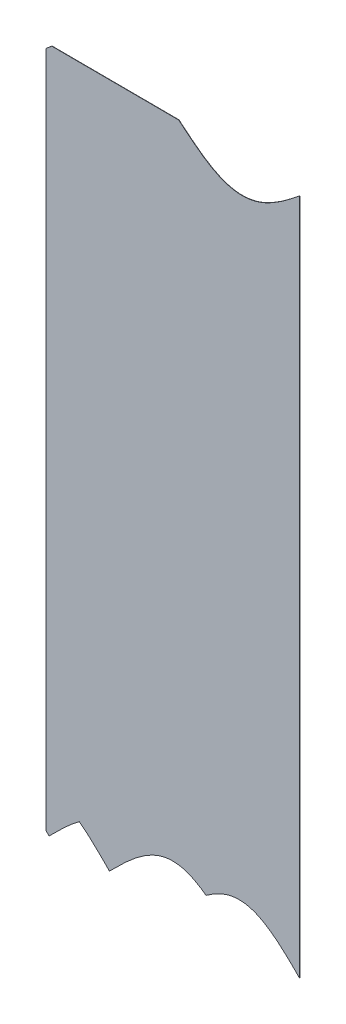
ISO-10303-21;
HEADER;
FILE_DESCRIPTION(('STEP AP214'),'2;1');
FILE_NAME('part.step','',(''),(''),'','','');
FILE_SCHEMA(('AUTOMOTIVE_DESIGN { 1 0 10303 214 1 1 1 1 }'));
ENDSEC;
DATA;
#1=APPLICATION_CONTEXT('core data for automotive mechanical design processes');
#2=APPLICATION_PROTOCOL_DEFINITION('international standard','automotive_design',2000,#1);
#3=PRODUCT_CONTEXT('',#1,'mechanical');
#4=PRODUCT('Part','Part','',(#3));
#5=PRODUCT_RELATED_PRODUCT_CATEGORY('part','',(#4));
#6=PRODUCT_DEFINITION_FORMATION('','',#4);
#7=PRODUCT_DEFINITION_CONTEXT('part definition',#1,'design');
#8=PRODUCT_DEFINITION('design','',#6,#7);
#9=PRODUCT_DEFINITION_SHAPE('','',#8);
#10=(LENGTH_UNIT() NAMED_UNIT(*) SI_UNIT(.MILLI.,.METRE.));
#11=(NAMED_UNIT(*) PLANE_ANGLE_UNIT() SI_UNIT($,.RADIAN.));
#12=(NAMED_UNIT(*) SI_UNIT($,.STERADIAN.) SOLID_ANGLE_UNIT());
#13=UNCERTAINTY_MEASURE_WITH_UNIT(LENGTH_MEASURE(1.E-05),#10,'distance_accuracy_value','');
#14=(GEOMETRIC_REPRESENTATION_CONTEXT(3) GLOBAL_UNCERTAINTY_ASSIGNED_CONTEXT((#13)) GLOBAL_UNIT_ASSIGNED_CONTEXT((#10,
#11,#12)) REPRESENTATION_CONTEXT('',''));
#15=CARTESIAN_POINT('',(0.,0.,0.));
#16=DIRECTION('',(0.,0.,1.));
#17=DIRECTION('',(1.,0.,0.));
#18=AXIS2_PLACEMENT_3D('',#15,#16,#17);
#19=CARTESIAN_POINT('',(322.330788957895,481.431997369776,168.147839988997));
#20=DIRECTION('',(0.757872648002997,0.652395697796506,0.00298377370707072));
#21=DIRECTION('',(0.652398601924532,-0.75787602165982,0.));
#22=AXIS2_PLACEMENT_3D('',#19,#20,#21);
#23=PLANE('',#22);
#24=CARTESIAN_POINT('',(322.330395257108,481.431997369776,168.247839213992));
#25=CARTESIAN_POINT('',(322.334377498887,481.427371222006,168.247854892231));
#26=B_SPLINE_CURVE_WITH_KNOTS('',1,(#24,#25),.UNSPECIFIED.,.F.,.F.,(2,2),(0.,1.),.UNSPECIFIED.);
#27=CARTESIAN_POINT('',(322.330395583371,481.431996990757,168.247839215277));
#28=VERTEX_POINT('',#27);
#29=CARTESIAN_POINT('',(322.334377620597,481.427371847329,168.24785489271));
#30=VERTEX_POINT('',#29);
#31=EDGE_CURVE('E184',#28,#30,#26,.T.);
#32=ORIENTED_EDGE('',*,*,#31,.T.);
#33=DIRECTION('',(-0.00393700787401531,0.,0.999992249954468));
#34=VECTOR('',#33,1.);
#35=CARTESIAN_POINT('',(322.334771321385,481.427371847329,168.147855667715));
#36=LINE('',#35,#34);
#37=CARTESIAN_POINT('',(322.334771321385,481.427371847329,168.147855667715));
#38=VERTEX_POINT('',#37);
#39=EDGE_CURVE('E183',#38,#30,#36,.T.);
#40=ORIENTED_EDGE('',*,*,#39,.F.);
#41=CARTESIAN_POINT('',(322.330788957895,481.431997369776,168.147839988997));
#42=CARTESIAN_POINT('',(322.334771199674,481.427371222006,168.147855667235));
#43=B_SPLINE_CURVE_WITH_KNOTS('',1,(#41,#42),.UNSPECIFIED.,.F.,.F.,(2,2),(0.,1.),.UNSPECIFIED.);
#44=CARTESIAN_POINT('',(322.330789284159,481.431996990757,168.147839990281));
#45=VERTEX_POINT('',#44);
#46=EDGE_CURVE('E272',#45,#38,#43,.T.);
#47=ORIENTED_EDGE('',*,*,#46,.F.);
#48=DIRECTION('',(-0.00393700787401531,0.,0.999992249954468));
#49=VECTOR('',#48,1.);
#50=CARTESIAN_POINT('',(322.330789284159,481.431996990757,168.147839990281));
#51=LINE('',#50,#49);
#52=EDGE_CURVE('E13',#45,#28,#51,.T.);
#53=ORIENTED_EDGE('',*,*,#52,.T.);
#54=EDGE_LOOP('',(#32,#40,#47,#53));
#55=FACE_BOUND('',#54,.T.);
#56=ADVANCED_FACE('F43',(#55),#23,.T.);
#57=CARTESIAN_POINT('',(320.56832134094,479.98219318182,168.140901086334));
#58=CARTESIAN_POINT('',(320.960198959357,480.302507821558,168.142443923561));
#59=CARTESIAN_POINT('',(321.890590486305,481.068483708455,168.146106910717));
#60=CARTESIAN_POINT('',(322.330788957895,481.431997369776,168.147839988997));
#61=B_SPLINE_CURVE_WITH_KNOTS('',2,(#57,#58,#59,#60),.UNSPECIFIED.,.F.,.F.,(3,1,3),(0.,0.5,1.),.UNSPECIFIED.);
#62=DIRECTION('',(-0.00393700787401531,0.,0.999992249954468));
#63=VECTOR('',#62,1.);
#64=SURFACE_OF_LINEAR_EXTRUSION('',#61,#63);
#65=CARTESIAN_POINT('',(320.567927640152,479.98219318182,168.24090031133));
#66=CARTESIAN_POINT('',(320.95980525857,480.302507821558,168.242443148556));
#67=CARTESIAN_POINT('',(321.890196785517,481.068483708455,168.246106135712));
#68=CARTESIAN_POINT('',(322.330395257108,481.431997369776,168.247839213992));
#69=B_SPLINE_CURVE_WITH_KNOTS('',2,(#65,#66,#67,#68),.UNSPECIFIED.,.F.,.F.,(3,1,3),(0.,0.5,1.),.UNSPECIFIED.);
#70=CARTESIAN_POINT('',(320.567927640152,479.98219318182,168.24090031133));
#71=VERTEX_POINT('',#70);
#72=EDGE_CURVE('E192',#71,#28,#69,.T.);
#73=ORIENTED_EDGE('',*,*,#72,.T.);
#74=ORIENTED_EDGE('',*,*,#52,.F.);
#75=CARTESIAN_POINT('',(320.56832134094,479.98219318182,168.140901086334));
#76=VERTEX_POINT('',#75);
#77=EDGE_CURVE('E115',#76,#45,#61,.T.);
#78=ORIENTED_EDGE('',*,*,#77,.F.);
#79=DIRECTION('',(-0.00393700787401531,0.,0.999992249954468));
#80=VECTOR('',#79,1.);
#81=CARTESIAN_POINT('',(320.56832134094,479.98219318182,168.140901086334));
#82=LINE('',#81,#80);
#83=EDGE_CURVE('E51',#76,#71,#82,.T.);
#84=ORIENTED_EDGE('',*,*,#83,.T.);
#85=EDGE_LOOP('',(#73,#74,#78,#84));
#86=FACE_BOUND('',#85,.T.);
#87=ADVANCED_FACE('F306',(#86),#64,.F.);
#88=CARTESIAN_POINT('',(320.56832134094,268.328764497974,168.140901086334));
#89=DIRECTION('',(-0.999992249954468,0.,-0.00393700787401531));
#90=DIRECTION('',(0.00393700787401531,0.,-0.999992249954468));
#91=AXIS2_PLACEMENT_3D('',#88,#89,#90);
#92=PLANE('',#91);
#93=DIRECTION('',(0.,1.,0.));
#94=VECTOR('',#93,1.);
#95=CARTESIAN_POINT('',(320.567927640152,268.328764497974,168.24090031133));
#96=LINE('',#95,#94);
#97=CARTESIAN_POINT('',(320.567927640152,268.328764497975,168.24090031133));
#98=VERTEX_POINT('',#97);
#99=EDGE_CURVE('E199',#98,#71,#96,.T.);
#100=ORIENTED_EDGE('',*,*,#99,.T.);
#101=ORIENTED_EDGE('',*,*,#83,.F.);
#102=DIRECTION('',(0.,1.,0.));
#103=VECTOR('',#102,1.);
#104=CARTESIAN_POINT('',(320.56832134094,268.328764497974,168.140901086334));
#105=LINE('',#104,#103);
#106=CARTESIAN_POINT('',(320.56832134094,268.328764497975,168.140901086334));
#107=VERTEX_POINT('',#106);
#108=EDGE_CURVE('E315',#107,#76,#105,.T.);
#109=ORIENTED_EDGE('',*,*,#108,.F.);
#110=DIRECTION('',(-0.00393700787401531,0.,0.999992249954468));
#111=VECTOR('',#110,1.);
#112=CARTESIAN_POINT('',(320.56832134094,268.328764497975,168.140901086334));
#113=LINE('',#112,#111);
#114=EDGE_CURVE('E300',#107,#98,#113,.T.);
#115=ORIENTED_EDGE('',*,*,#114,.T.);
#116=EDGE_LOOP('',(#100,#101,#109,#115));
#117=FACE_BOUND('',#116,.T.);
#118=ADVANCED_FACE('F332',(#117),#92,.T.);
#119=CARTESIAN_POINT('',(320.56832134094,268.328764497975,168.140901086334));
#120=CARTESIAN_POINT('',(320.757077697651,268.139733582945,168.141644227356));
#121=CARTESIAN_POINT('',(321.002892084208,267.893118426474,168.142612008032));
#122=CARTESIAN_POINT('',(321.022755719495,267.873188574578,168.142690211927));
#123=CARTESIAN_POINT('',(321.179185315276,267.716228172024,168.14330608125));
#124=CARTESIAN_POINT('',(321.462292284474,267.432000000001,168.144420684255));
#125=B_SPLINE_CURVE_WITH_KNOTS('',2,(#119,#120,#121,#122,#123,#124),.UNSPECIFIED.,.F.,.F.,(3,1,
1,1,3),(0.,0.475,0.5,0.525,1.),.UNSPECIFIED.);
#126=DIRECTION('',(-0.00393700787401531,0.,0.999992249954468));
#127=VECTOR('',#126,1.);
#128=SURFACE_OF_LINEAR_EXTRUSION('',#125,#127);
#129=CARTESIAN_POINT('',(320.567927640152,268.328764497975,168.24090031133));
#130=CARTESIAN_POINT('',(320.756683996863,268.139733582945,168.241643452352));
#131=CARTESIAN_POINT('',(321.002498383421,267.893118426474,168.242611233028));
#132=CARTESIAN_POINT('',(321.022362018708,267.873188574578,168.242689436922));
#133=CARTESIAN_POINT('',(321.178791614489,267.716228172024,168.243305306245));
#134=CARTESIAN_POINT('',(321.461898583686,267.432000000001,168.244419909251));
#135=B_SPLINE_CURVE_WITH_KNOTS('',2,(#129,#130,#131,#132,#133,#134),.UNSPECIFIED.,.F.,.F.,(3,1,
1,1,3),(0.,0.475,0.5,0.525,1.),.UNSPECIFIED.);
#136=CARTESIAN_POINT('',(321.461898230831,267.432000354254,168.244419907861));
#137=VERTEX_POINT('',#136);
#138=EDGE_CURVE('E204',#98,#137,#135,.T.);
#139=ORIENTED_EDGE('',*,*,#138,.F.);
#140=ORIENTED_EDGE('',*,*,#114,.F.);
#141=CARTESIAN_POINT('',(321.462291931618,267.432000354254,168.144420682866));
#142=VERTEX_POINT('',#141);
#143=EDGE_CURVE('E342',#107,#142,#125,.T.);
#144=ORIENTED_EDGE('',*,*,#143,.T.);
#145=DIRECTION('',(-0.00393700787401531,0.,0.999992249954468));
#146=VECTOR('',#145,1.);
#147=CARTESIAN_POINT('',(321.462291931618,267.432000354254,168.144420682866));
#148=LINE('',#147,#146);
#149=EDGE_CURVE('E297',#142,#137,#148,.T.);
#150=ORIENTED_EDGE('',*,*,#149,.T.);
#151=EDGE_LOOP('',(#139,#140,#144,#150));
#152=FACE_BOUND('',#151,.T.);
#153=ADVANCED_FACE('F335',(#152),#128,.T.);
#154=CARTESIAN_POINT('',(321.462292284474,267.432000000001,168.144420684255));
#155=CARTESIAN_POINT('',(321.856559645749,267.827828797905,168.145972929991));
#156=CARTESIAN_POINT('',(322.053749962608,268.025583728596,168.146749275838));
#157=CARTESIAN_POINT('',(322.382250878624,268.355025239281,168.148042596554));
#158=CARTESIAN_POINT('',(322.960527736483,268.933055903792,168.150319294741));
#159=CARTESIAN_POINT('',(323.546316052846,269.515388330365,168.152625565829));
#160=CARTESIAN_POINT('',(324.134607955361,270.095711116484,168.154941693632));
#161=CARTESIAN_POINT('',(324.72403774647,270.67137834553,168.157262301345));
#162=CARTESIAN_POINT('',(325.314080163924,271.240600306046,168.159585320992));
#163=CARTESIAN_POINT('',(325.904490023213,271.801883833022,168.161909787272));
#164=CARTESIAN_POINT('',(326.805976568551,272.644362399339,168.165458974406));
#165=CARTESIAN_POINT('',(327.98460798061,273.700660867898,168.170099291518));
#166=CARTESIAN_POINT('',(329.164459067439,274.703581992053,168.174744410537));
#167=CARTESIAN_POINT('',(330.345019926099,275.643834369482,168.179392323955));
#168=CARTESIAN_POINT('',(330.925615134616,276.071090350348,168.181678149578));
#169=B_SPLINE_CURVE_WITH_KNOTS('',2,(#154,#155,#156,#157,#158,#159,#160,#161,#162,#163,#164,
#165,#166,#167,#168),.UNSPECIFIED.,.F.,.F.,(3,2,1,1,1,1,1,1,1,1,1,1,3),(0.,0.0625,0.125,0.1875,
0.25,0.3125,0.375,0.4375,0.5,0.625,0.75,0.875,1.),.UNSPECIFIED.);
#170=DIRECTION('',(-0.00393700787401531,0.,0.999992249954468));
#171=VECTOR('',#170,1.);
#172=SURFACE_OF_LINEAR_EXTRUSION('',#169,#171);
#173=CARTESIAN_POINT('',(321.461898583686,267.432000000001,168.244419909251));
#174=CARTESIAN_POINT('',(321.856165944962,267.827828797905,168.245972154986));
#175=CARTESIAN_POINT('',(322.053356261821,268.025583728596,168.246748500833));
#176=CARTESIAN_POINT('',(322.381857177836,268.355025239281,168.24804182155));
#177=CARTESIAN_POINT('',(322.960134035696,268.933055903792,168.250318519737));
#178=CARTESIAN_POINT('',(323.545922352059,269.515388330365,168.252624790825));
#179=CARTESIAN_POINT('',(324.134214254573,270.095711116484,168.254940918627));
#180=CARTESIAN_POINT('',(324.723644045682,270.67137834553,168.257261526341));
#181=CARTESIAN_POINT('',(325.313686463137,271.240600306046,168.259584545988));
#182=CARTESIAN_POINT('',(325.904096322425,271.801883833022,168.261909012267));
#183=CARTESIAN_POINT('',(326.805582867764,272.644362399339,168.265458199401));
#184=CARTESIAN_POINT('',(327.984214279823,273.700660867898,168.270098516513));
#185=CARTESIAN_POINT('',(329.164065366652,274.703581992053,168.274743635532));
#186=CARTESIAN_POINT('',(330.344626225312,275.643834369482,168.27939154895));
#187=CARTESIAN_POINT('',(330.925221433828,276.071090350348,168.281677374573));
#188=B_SPLINE_CURVE_WITH_KNOTS('',2,(#173,#174,#175,#176,#177,#178,#179,#180,#181,#182,#183,
#184,#185,#186,#187),.UNSPECIFIED.,.F.,.F.,(3,2,1,1,1,1,1,1,1,1,1,1,3),(0.,0.0625,0.125,0.1875,
0.25,0.3125,0.375,0.4375,0.5,0.625,0.75,0.875,1.),.UNSPECIFIED.);
#189=CARTESIAN_POINT('',(330.925221012033,276.071090039952,168.281677372912));
#190=VERTEX_POINT('',#189);
#191=EDGE_CURVE('E209',#137,#190,#188,.T.);
#192=ORIENTED_EDGE('',*,*,#191,.F.);
#193=ORIENTED_EDGE('',*,*,#149,.F.);
#194=CARTESIAN_POINT('',(330.925614712821,276.071090039952,168.181678147917));
#195=VERTEX_POINT('',#194);
#196=EDGE_CURVE('E347',#142,#195,#169,.T.);
#197=ORIENTED_EDGE('',*,*,#196,.T.);
#198=DIRECTION('',(-0.00393700787401531,0.,0.999992249954468));
#199=VECTOR('',#198,1.);
#200=CARTESIAN_POINT('',(330.925614712821,276.071090039952,168.181678147917));
#201=LINE('',#200,#199);
#202=EDGE_CURVE('E294',#195,#190,#201,.T.);
#203=ORIENTED_EDGE('',*,*,#202,.T.);
#204=EDGE_LOOP('',(#192,#193,#197,#203));
#205=FACE_BOUND('',#204,.T.);
#206=ADVANCED_FACE('F338',(#205),#172,.T.);
#207=CARTESIAN_POINT('',(330.925615134616,276.071090350348,168.181678149578));
#208=CARTESIAN_POINT('',(331.506176417281,275.643859335281,168.183963841633));
#209=CARTESIAN_POINT('',(332.686700785038,274.703640046976,168.188611611385));
#210=CARTESIAN_POINT('',(333.866551930113,273.700722389315,168.193256730633));
#211=CARTESIAN_POINT('',(335.045183436303,272.644426811852,168.197897048116));
#212=CARTESIAN_POINT('',(335.946669796317,271.801950263575,168.20144623452));
#213=CARTESIAN_POINT('',(336.537079697635,271.240667759343,168.203770700965));
#214=CARTESIAN_POINT('',(337.127122179268,270.671446651715,168.206093720865));
#215=CARTESIAN_POINT('',(337.716552064583,270.095780094944,168.208414328949));
#216=CARTESIAN_POINT('',(338.304844141954,269.515457748929,168.21073045744));
#217=CARTESIAN_POINT('',(338.890632893447,268.933125348367,168.213036730241));
#218=CARTESIAN_POINT('',(339.468911403546,268.355093334999,168.215313434933));
#219=CARTESIAN_POINT('',(339.797480306624,268.025583728596,168.216607023317));
#220=CARTESIAN_POINT('',(339.994623638438,267.827875969089,168.217383184182));
#221=CARTESIAN_POINT('',(340.388937984758,267.432000000001,168.2189356149));
#222=B_SPLINE_CURVE_WITH_KNOTS('',2,(#207,#208,#209,#210,#211,#212,#213,#214,#215,#216,#217,
#218,#219,#220,#221),.UNSPECIFIED.,.F.,.F.,(3,1,1,1,1,1,1,1,1,1,1,2,3),(0.,0.125,0.25,0.375,0.5,
0.5625,0.625,0.6875,0.75,0.8125,0.875,0.9375,1.),.UNSPECIFIED.);
#223=DIRECTION('',(-0.00393700787401531,0.,0.999992249954468));
#224=VECTOR('',#223,1.);
#225=SURFACE_OF_LINEAR_EXTRUSION('',#222,#224);
#226=CARTESIAN_POINT('',(330.925221433828,276.071090350348,168.281677374573));
#227=CARTESIAN_POINT('',(331.505782716493,275.643859335281,168.283963066628));
#228=CARTESIAN_POINT('',(332.68630708425,274.703640046976,168.28861083638));
#229=CARTESIAN_POINT('',(333.866158229326,273.700722389315,168.293255955628));
#230=CARTESIAN_POINT('',(335.044789735516,272.644426811852,168.297896273112));
#231=CARTESIAN_POINT('',(335.946276095529,271.801950263575,168.301445459516));
#232=CARTESIAN_POINT('',(336.536685996848,271.240667759343,168.303769925961));
#233=CARTESIAN_POINT('',(337.12672847848,270.671446651715,168.30609294586));
#234=CARTESIAN_POINT('',(337.716158363795,270.095780094944,168.308413553945));
#235=CARTESIAN_POINT('',(338.304450441167,269.515457748929,168.310729682436));
#236=CARTESIAN_POINT('',(338.89023919266,268.933125348367,168.313035955237));
#237=CARTESIAN_POINT('',(339.468517702759,268.355093334999,168.315312659929));
#238=CARTESIAN_POINT('',(339.797086605837,268.025583728596,168.316606248313));
#239=CARTESIAN_POINT('',(339.994229937651,267.827875969089,168.317382409178));
#240=CARTESIAN_POINT('',(340.38854428397,267.432000000001,168.318934839895));
#241=B_SPLINE_CURVE_WITH_KNOTS('',2,(#226,#227,#228,#229,#230,#231,#232,#233,#234,#235,#236,
#237,#238,#239,#240),.UNSPECIFIED.,.F.,.F.,(3,1,1,1,1,1,1,1,1,1,1,2,3),(0.,0.125,0.25,0.375,0.5,
0.5625,0.625,0.6875,0.75,0.8125,0.875,0.9375,1.),.UNSPECIFIED.);
#242=CARTESIAN_POINT('',(340.388543931114,267.432000354254,168.318934838506));
#243=VERTEX_POINT('',#242);
#244=EDGE_CURVE('E217',#190,#243,#241,.T.);
#245=ORIENTED_EDGE('',*,*,#244,.F.);
#246=ORIENTED_EDGE('',*,*,#202,.F.);
#247=CARTESIAN_POINT('',(340.388937631902,267.432000354254,168.218935613511));
#248=VERTEX_POINT('',#247);
#249=EDGE_CURVE('E356',#195,#248,#222,.T.);
#250=ORIENTED_EDGE('',*,*,#249,.T.);
#251=DIRECTION('',(-0.00393700787401531,0.,0.999992249954468));
#252=VECTOR('',#251,1.);
#253=CARTESIAN_POINT('',(340.388937631902,267.432000354254,168.218935613511));
#254=LINE('',#253,#252);
#255=EDGE_CURVE('E291',#248,#243,#254,.T.);
#256=ORIENTED_EDGE('',*,*,#255,.T.);
#257=EDGE_LOOP('',(#245,#246,#250,#256));
#258=FACE_BOUND('',#257,.T.);
#259=ADVANCED_FACE('F373',(#258),#225,.T.);
#260=CARTESIAN_POINT('',(340.388937984758,267.432000000001,168.2189356149));
#261=CARTESIAN_POINT('',(340.704297832972,267.748608783548,168.220177198728));
#262=CARTESIAN_POINT('',(340.862024175728,267.906849069204,168.220798173394));
#263=CARTESIAN_POINT('',(341.124788873571,268.170469971843,168.221832688096));
#264=CARTESIAN_POINT('',(341.587342588013,268.633557245671,168.223653779825));
#265=CARTESIAN_POINT('',(342.055904403843,269.101017228589,168.225498525681));
#266=CARTESIAN_POINT('',(342.78550764524,269.825329577419,168.228371001649));
#267=CARTESIAN_POINT('',(343.722519235765,270.74246865894,168.232060052249));
#268=CARTESIAN_POINT('',(344.6635351191,271.645243159154,168.235764867904));
#269=CARTESIAN_POINT('',(345.606370128187,272.526385528975,168.239476845526));
#270=CARTESIAN_POINT('',(346.550183558413,273.380108286688,168.243192675231));
#271=CARTESIAN_POINT('',(347.494582875178,274.201232462322,168.246910811593));
#272=CARTESIAN_POINT('',(348.439360058703,274.984949854647,168.250630435631));
#273=CARTESIAN_POINT('',(349.384394484902,275.726751330112,168.254351072443));
#274=CARTESIAN_POINT('',(350.329611226209,276.422409555424,168.258072427037));
#275=CARTESIAN_POINT('',(351.274961206061,277.067982323384,168.261794306196));
#276=CARTESIAN_POINT('',(352.220410846477,277.659823943802,168.265516577722));
#277=CARTESIAN_POINT('',(353.165936239217,278.19459965208,168.269239147489));
#278=CARTESIAN_POINT('',(354.111519825465,278.669300800495,168.272961946365));
#279=CARTESIAN_POINT('',(355.057148283643,279.081259515709,168.276684921904));
#280=CARTESIAN_POINT('',(356.002811185809,279.428162251105,168.28040803305));
#281=CARTESIAN_POINT('',(356.948500128554,279.708061844443,168.284131246719));
#282=CARTESIAN_POINT('',(357.894208104061,279.919387809357,168.287854535321));
#283=CARTESIAN_POINT('',(358.839929067906,280.060954732553,168.291577875059));
#284=CARTESIAN_POINT('',(359.785657599605,280.131968642999,168.295301244591));
#285=CARTESIAN_POINT('',(360.731388615642,280.132031301646,168.299024623904));
#286=CARTESIAN_POINT('',(361.677117153637,280.061142357328,168.302747993461));
#287=CARTESIAN_POINT('',(362.622838139388,279.919699347624,168.306471333285));
#288=CARTESIAN_POINT('',(363.568546147946,279.708495547372,168.310194622016));
#289=CARTESIAN_POINT('',(364.514235132811,279.428715686129,168.313917835851));
#290=CARTESIAN_POINT('',(365.459898083884,279.081929578747,168.31764094719));
#291=CARTESIAN_POINT('',(366.405526610589,278.670083729619,168.321363922999));
#292=CARTESIAN_POINT('',(367.351110294364,278.195491043832,168.325086722259));
#293=CARTESIAN_POINT('',(368.296635798562,277.660818792983,168.328809292465));
#294=CARTESIAN_POINT('',(369.242085582141,277.069075032847,168.332531564555));
#295=CARTESIAN_POINT('',(370.187418584275,276.423605687197,168.336253376872));
#296=CARTESIAN_POINT('',(370.666454206828,276.071090350347,168.338139358506));
#297=B_SPLINE_CURVE_WITH_KNOTS('',2,(#260,#261,#262,#263,#264,#265,#266,#267,#268,#269,#270,
#271,#272,#273,#274,#275,#276,#277,#278,#279,#280,#281,#282,#283,#284,#285,#286,#287,#288,#289,
#290,#291,#292,#293,#294,#295,#296),.UNSPECIFIED.,.F.,.F.,(3,2,1,1,1,1,1,1,1,1,1,1,1,1,1,1,1,1,
1,1,1,1,1,1,1,1,1,1,1,1,1,1,1,1,3),(0.,0.015625,0.03125,0.046875,0.0625,0.09375,0.125,0.15625,
0.1875,0.21875,0.25,0.28125,0.3125,0.34375,0.375,0.40625,0.4375,0.46875,0.5,0.53125,0.5625,
0.59375,0.625,0.65625,0.6875,0.71875,0.75,0.78125,0.8125,0.84375,0.875,0.90625,0.9375,0.96875,
1.),.UNSPECIFIED.);
#298=DIRECTION('',(-0.00393700787401531,0.,0.999992249954468));
#299=VECTOR('',#298,1.);
#300=SURFACE_OF_LINEAR_EXTRUSION('',#297,#299);
#301=CARTESIAN_POINT('',(340.38854428397,267.432000000001,168.318934839895));
#302=CARTESIAN_POINT('',(340.703904132185,267.748608783548,168.320176423723));
#303=CARTESIAN_POINT('',(340.86163047494,267.906849069204,168.320797398389));
#304=CARTESIAN_POINT('',(341.124395172783,268.170469971843,168.321831913091));
#305=CARTESIAN_POINT('',(341.586948887226,268.633557245671,168.323653004821));
#306=CARTESIAN_POINT('',(342.055510703056,269.101017228589,168.325497750676));
#307=CARTESIAN_POINT('',(342.785113944452,269.825329577419,168.328370226644));
#308=CARTESIAN_POINT('',(343.722125534978,270.74246865894,168.332059277244));
#309=CARTESIAN_POINT('',(344.663141418312,271.645243159154,168.335764092899));
#310=CARTESIAN_POINT('',(345.6059764274,272.526385528975,168.339476070522));
#311=CARTESIAN_POINT('',(346.549789857626,273.380108286688,168.343191900226));
#312=CARTESIAN_POINT('',(347.49418917439,274.201232462322,168.346910036588));
#313=CARTESIAN_POINT('',(348.438966357916,274.984949854647,168.350629660626));
#314=CARTESIAN_POINT('',(349.384000784114,275.726751330112,168.354350297438));
#315=CARTESIAN_POINT('',(350.329217525422,276.422409555424,168.358071652032));
#316=CARTESIAN_POINT('',(351.274567505274,277.067982323384,168.361793531191));
#317=CARTESIAN_POINT('',(352.220017145689,277.659823943802,168.365515802718));
#318=CARTESIAN_POINT('',(353.16554253843,278.19459965208,168.369238372484));
#319=CARTESIAN_POINT('',(354.111126124678,278.669300800495,168.372961171361));
#320=CARTESIAN_POINT('',(355.056754582855,279.081259515709,168.3766841469));
#321=CARTESIAN_POINT('',(356.002417485021,279.428162251105,168.380407258046));
#322=CARTESIAN_POINT('',(356.948106427767,279.708061844443,168.384130471715));
#323=CARTESIAN_POINT('',(357.893814403273,279.919387809357,168.387853760317));
#324=CARTESIAN_POINT('',(358.839535367119,280.060954732553,168.391577100054));
#325=CARTESIAN_POINT('',(359.785263898818,280.131968642999,168.395300469586));
#326=CARTESIAN_POINT('',(360.730994914854,280.132031301646,168.399023848899));
#327=CARTESIAN_POINT('',(361.67672345285,280.061142357328,168.402747218456));
#328=CARTESIAN_POINT('',(362.622444438601,279.919699347624,168.40647055828));
#329=CARTESIAN_POINT('',(363.568152447158,279.708495547372,168.410193847012));
#330=CARTESIAN_POINT('',(364.513841432023,279.428715686129,168.413917060847));
#331=CARTESIAN_POINT('',(365.459504383097,279.081929578747,168.417640172186));
#332=CARTESIAN_POINT('',(366.405132909801,278.670083729619,168.421363147994));
#333=CARTESIAN_POINT('',(367.350716593576,278.195491043832,168.425085947255));
#334=CARTESIAN_POINT('',(368.296242097775,277.660818792983,168.42880851746));
#335=CARTESIAN_POINT('',(369.241691881353,277.069075032847,168.43253078955));
#336=CARTESIAN_POINT('',(370.187024883487,276.423605687197,168.436252601867));
#337=CARTESIAN_POINT('',(370.66606050604,276.071090350347,168.438138583502));
#338=B_SPLINE_CURVE_WITH_KNOTS('',2,(#301,#302,#303,#304,#305,#306,#307,#308,#309,#310,#311,
#312,#313,#314,#315,#316,#317,#318,#319,#320,#321,#322,#323,#324,#325,#326,#327,#328,#329,#330,
#331,#332,#333,#334,#335,#336,#337),.UNSPECIFIED.,.F.,.F.,(3,2,1,1,1,1,1,1,1,1,1,1,1,1,1,1,1,1,
1,1,1,1,1,1,1,1,1,1,1,1,1,1,1,1,3),(0.,0.015625,0.03125,0.046875,0.0625,0.09375,0.125,0.15625,
0.1875,0.21875,0.25,0.28125,0.3125,0.34375,0.375,0.40625,0.4375,0.46875,0.5,0.53125,0.5625,
0.59375,0.625,0.65625,0.6875,0.71875,0.75,0.78125,0.8125,0.84375,0.875,0.90625,0.9375,0.96875,
1.),.UNSPECIFIED.);
#339=CARTESIAN_POINT('',(370.666060084242,276.071090660742,168.438138581841));
#340=VERTEX_POINT('',#339);
#341=EDGE_CURVE('E225',#243,#340,#338,.T.);
#342=ORIENTED_EDGE('',*,*,#341,.F.);
#343=ORIENTED_EDGE('',*,*,#255,.F.);
#344=CARTESIAN_POINT('',(370.66645378503,276.071090660742,168.338139356846));
#345=VERTEX_POINT('',#344);
#346=EDGE_CURVE('E365',#248,#345,#297,.T.);
#347=ORIENTED_EDGE('',*,*,#346,.T.);
#348=DIRECTION('',(-0.00393700787401531,0.,0.999992249954468));
#349=VECTOR('',#348,1.);
#350=CARTESIAN_POINT('',(370.66645378503,276.071090660742,168.338139356846));
#351=LINE('',#350,#349);
#352=EDGE_CURVE('E288',#345,#340,#351,.T.);
#353=ORIENTED_EDGE('',*,*,#352,.T.);
#354=EDGE_LOOP('',(#342,#343,#347,#353));
#355=FACE_BOUND('',#354,.T.);
#356=ADVANCED_FACE('F376',(#355),#300,.T.);
#357=CARTESIAN_POINT('',(370.666454206828,276.071090350347,168.338139358506));
#358=CARTESIAN_POINT('',(371.129561941891,276.411884586804,168.339962631436));
#359=CARTESIAN_POINT('',(372.043886232976,277.037834969649,168.343562361268));
#360=CARTESIAN_POINT('',(372.958350462174,277.613706279491,168.347162642041));
#361=CARTESIAN_POINT('',(373.872882391955,278.136428954093,168.350763189354));
#362=CARTESIAN_POINT('',(374.787466749569,278.603252691807,168.354363943077));
#363=CARTESIAN_POINT('',(375.702091883396,279.011723721842,168.357964857338));
#364=CARTESIAN_POINT('',(376.616748632295,279.359696494126,168.361565896069));
#365=CARTESIAN_POINT('',(377.53142959201,279.645344160638,168.365167030118));
#366=CARTESIAN_POINT('',(378.446128610359,279.867167631212,168.368768235265));
#367=CARTESIAN_POINT('',(379.360840398394,280.024003068538,168.372369490687));
#368=CARTESIAN_POINT('',(380.275560231323,280.115027749804,168.375970777782));
#369=CARTESIAN_POINT('',(381.190283737134,280.139764233728,168.379572079337));
#370=CARTESIAN_POINT('',(382.105006713335,280.098082779337,168.383173378807));
#371=CARTESIAN_POINT('',(383.019724918322,279.990202003792,168.386774659493));
#372=CARTESIAN_POINT('',(383.934433915215,279.816687775604,168.390375903926));
#373=CARTESIAN_POINT('',(384.849128862997,279.578450341895,168.393977093047));
#374=CARTESIAN_POINT('',(385.763804266927,279.276739735541,168.397578205223));
#375=CARTESIAN_POINT('',(386.6784537017,278.913139476503,168.401179215158));
#376=CARTESIAN_POINT('',(387.59306938089,278.489558670829,168.404780092196));
#377=CARTESIAN_POINT('',(388.507641589202,278.00822258343,168.408380798087));
#378=CARTESIAN_POINT('',(389.42215787115,277.471661825519,168.411981283794));
#379=CARTESIAN_POINT('',(390.336601780019,276.882700393442,168.415581484565));
#380=CARTESIAN_POINT('',(391.250950945471,276.244442892535,168.419181312328));
#381=CARTESIAN_POINT('',(392.165173923965,275.560261543025,168.422780643288));
#382=CARTESIAN_POINT('',(393.079224945869,274.833783971913,168.426379297248));
#383=CARTESIAN_POINT('',(393.993034376951,274.068884008509,168.429977000056));
#384=CARTESIAN_POINT('',(394.90649051121,273.269680036549,168.433573311921));
#385=CARTESIAN_POINT('',(395.819402011464,272.440551718686,168.43716747954));
#386=CARTESIAN_POINT('',(396.73141097789,271.586205287922,168.44075809385));
#387=CARTESIAN_POINT('',(397.641760579793,270.71188392867,168.444342175177));
#388=CARTESIAN_POINT('',(398.548523742505,269.824118179228,168.447912136556));
#389=CARTESIAN_POINT('',(399.253691623123,269.124201585034,168.450688409571));
#390=CARTESIAN_POINT('',(399.707348986316,268.671741241076,168.452474476024));
#391=CARTESIAN_POINT('',(399.950393700787,268.428486315291,168.453431352394));
#392=B_SPLINE_CURVE_WITH_KNOTS('',2,(#357,#358,#359,#360,#361,#362,#363,#364,#365,#366,#367,
#368,#369,#370,#371,#372,#373,#374,#375,#376,#377,#378,#379,#380,#381,#382,#383,#384,#385,#386,
#387,#388,#389,#390,#391),.UNSPECIFIED.,.F.,.F.,(3,1,1,1,1,1,1,1,1,1,1,1,1,1,1,1,1,1,1,1,1,1,1,
1,1,1,1,1,1,1,1,1,1,3),(0.,0.03125,0.0625,0.09375,0.125,0.15625,0.1875,0.21875,0.25,0.28125,
0.3125,0.34375,0.375,0.40625,0.4375,0.46875,0.5,0.53125,0.5625,0.59375,0.625,0.65625,0.6875,
0.71875,0.75,0.78125,0.8125,0.84375,0.875,0.90625,0.9375,0.96875,0.984375,1.),.UNSPECIFIED.);
#393=DIRECTION('',(-0.00393700787401531,0.,0.999992249954468));
#394=VECTOR('',#393,1.);
#395=SURFACE_OF_LINEAR_EXTRUSION('',#392,#394);
#396=CARTESIAN_POINT('',(370.66606050604,276.071090350347,168.438138583502));
#397=CARTESIAN_POINT('',(371.129168241104,276.411884586804,168.439961856432));
#398=CARTESIAN_POINT('',(372.043492532189,277.037834969649,168.443561586263));
#399=CARTESIAN_POINT('',(372.957956761386,277.613706279491,168.447161867036));
#400=CARTESIAN_POINT('',(373.872488691168,278.136428954093,168.450762414349));
#401=CARTESIAN_POINT('',(374.787073048782,278.603252691807,168.454363168073));
#402=CARTESIAN_POINT('',(375.701698182608,279.011723721842,168.457964082334));
#403=CARTESIAN_POINT('',(376.616354931508,279.359696494126,168.461565121064));
#404=CARTESIAN_POINT('',(377.531035891222,279.645344160638,168.465166255114));
#405=CARTESIAN_POINT('',(378.445734909572,279.867167631212,168.468767460261));
#406=CARTESIAN_POINT('',(379.360446697607,280.024003068538,168.472368715683));
#407=CARTESIAN_POINT('',(380.275166530535,280.115027749804,168.475970002778));
#408=CARTESIAN_POINT('',(381.189890036347,280.139764233728,168.479571304333));
#409=CARTESIAN_POINT('',(382.104613012548,280.098082779337,168.483172603803));
#410=CARTESIAN_POINT('',(383.019331217534,279.990202003792,168.486773884489));
#411=CARTESIAN_POINT('',(383.934040214428,279.816687775604,168.490375128922));
#412=CARTESIAN_POINT('',(384.84873516221,279.578450341895,168.493976318043));
#413=CARTESIAN_POINT('',(385.76341056614,279.276739735541,168.497577430219));
#414=CARTESIAN_POINT('',(386.678060000913,278.913139476503,168.501178440154));
#415=CARTESIAN_POINT('',(387.592675680102,278.489558670829,168.504779317191));
#416=CARTESIAN_POINT('',(388.507247888415,278.00822258343,168.508380023082));
#417=CARTESIAN_POINT('',(389.421764170363,277.471661825519,168.511980508789));
#418=CARTESIAN_POINT('',(390.336208079232,276.882700393442,168.51558070956));
#419=CARTESIAN_POINT('',(391.250557244683,276.244442892535,168.519180537323));
#420=CARTESIAN_POINT('',(392.164780223177,275.560261543025,168.522779868283));
#421=CARTESIAN_POINT('',(393.078831245082,274.833783971913,168.526378522243));
#422=CARTESIAN_POINT('',(393.992640676164,274.068884008509,168.529976225051));
#423=CARTESIAN_POINT('',(394.906096810423,273.269680036549,168.533572536916));
#424=CARTESIAN_POINT('',(395.819008310677,272.440551718686,168.537166704536));
#425=CARTESIAN_POINT('',(396.731017277102,271.586205287922,168.540757318845));
#426=CARTESIAN_POINT('',(397.641366879005,270.71188392867,168.544341400173));
#427=CARTESIAN_POINT('',(398.548130041717,269.824118179228,168.547911361552));
#428=CARTESIAN_POINT('',(399.253297922336,269.124201585034,168.550687634566));
#429=CARTESIAN_POINT('',(399.706955285528,268.671741241076,168.552473701019));
#430=CARTESIAN_POINT('',(399.95,268.428486315291,168.55343057739));
#431=B_SPLINE_CURVE_WITH_KNOTS('',2,(#396,#397,#398,#399,#400,#401,#402,#403,#404,#405,#406,
#407,#408,#409,#410,#411,#412,#413,#414,#415,#416,#417,#418,#419,#420,#421,#422,#423,#424,#425,
#426,#427,#428,#429,#430),.UNSPECIFIED.,.F.,.F.,(3,1,1,1,1,1,1,1,1,1,1,1,1,1,1,1,1,1,1,1,1,1,1,
1,1,1,1,1,1,1,1,1,1,3),(0.,0.03125,0.0625,0.09375,0.125,0.15625,0.1875,0.21875,0.25,0.28125,
0.3125,0.34375,0.375,0.40625,0.4375,0.46875,0.5,0.53125,0.5625,0.59375,0.625,0.65625,0.6875,
0.71875,0.75,0.78125,0.8125,0.84375,0.875,0.90625,0.9375,0.96875,0.984375,1.),.UNSPECIFIED.);
#432=CARTESIAN_POINT('',(399.95,268.428486315291,168.55343057739));
#433=VERTEX_POINT('',#432);
#434=EDGE_CURVE('E233',#340,#433,#431,.T.);
#435=ORIENTED_EDGE('',*,*,#434,.F.);
#436=ORIENTED_EDGE('',*,*,#352,.F.);
#437=CARTESIAN_POINT('',(399.950393700787,268.428486315291,168.453431352394));
#438=VERTEX_POINT('',#437);
#439=EDGE_CURVE('E387',#345,#438,#392,.T.);
#440=ORIENTED_EDGE('',*,*,#439,.T.);
#441=DIRECTION('',(-0.00393700787401531,0.,0.999992249954468));
#442=VECTOR('',#441,1.);
#443=CARTESIAN_POINT('',(399.950393700787,268.428486315291,168.453431352394));
#444=LINE('',#443,#442);
#445=EDGE_CURVE('E285',#438,#433,#444,.T.);
#446=ORIENTED_EDGE('',*,*,#445,.T.);
#447=EDGE_LOOP('',(#435,#436,#440,#446));
#448=FACE_BOUND('',#447,.T.);
#449=ADVANCED_FACE('F380',(#448),#395,.T.);
#450=CARTESIAN_POINT('',(399.950393700787,268.42848631529,168.453431352394));
#451=DIRECTION('',(-0.999992249954468,0.,-0.00393700787401531));
#452=DIRECTION('',(0.00393700787401531,0.,-0.999992249954468));
#453=AXIS2_PLACEMENT_3D('',#450,#451,#452);
#454=PLANE('',#453);
#455=DIRECTION('',(0.,1.,0.));
#456=VECTOR('',#455,1.);
#457=CARTESIAN_POINT('',(399.95,268.42848631529,168.55343057739));
#458=LINE('',#457,#456);
#459=CARTESIAN_POINT('',(399.95,479.900822082311,168.55343057739));
#460=VERTEX_POINT('',#459);
#461=EDGE_CURVE('E241',#433,#460,#458,.T.);
#462=ORIENTED_EDGE('',*,*,#461,.F.);
#463=ORIENTED_EDGE('',*,*,#445,.F.);
#464=DIRECTION('',(0.,1.,0.));
#465=VECTOR('',#464,1.);
#466=CARTESIAN_POINT('',(399.950393700787,268.42848631529,168.453431352394));
#467=LINE('',#466,#465);
#468=CARTESIAN_POINT('',(399.950393700787,479.900822082311,168.453431352394));
#469=VERTEX_POINT('',#468);
#470=EDGE_CURVE('E393',#438,#469,#467,.T.);
#471=ORIENTED_EDGE('',*,*,#470,.T.);
#472=DIRECTION('',(-0.00393700787401531,0.,0.999992249954468));
#473=VECTOR('',#472,1.);
#474=CARTESIAN_POINT('',(399.950393700787,479.900822082311,168.453431352394));
#475=LINE('',#474,#473);
#476=EDGE_CURVE('E282',#469,#460,#475,.T.);
#477=ORIENTED_EDGE('',*,*,#476,.T.);
#478=EDGE_LOOP('',(#462,#463,#471,#477));
#479=FACE_BOUND('',#478,.T.);
#480=ADVANCED_FACE('F384',(#479),#454,.F.);
#481=CARTESIAN_POINT('',(362.081381471154,481.432002655751,168.304339597597));
#482=CARTESIAN_POINT('',(362.082989745845,481.43073046271,168.304345929436));
#483=CARTESIAN_POINT('',(362.344230844687,481.214232144765,168.305374445671));
#484=CARTESIAN_POINT('',(362.47934447353,481.102259436391,168.305906393214));
#485=CARTESIAN_POINT('',(362.898548420095,480.755123336563,168.307556815243));
#486=CARTESIAN_POINT('',(363.716500626717,480.0795495206,168.310777124479));
#487=CARTESIAN_POINT('',(364.18282237952,479.698372438409,168.31261305112));
#488=CARTESIAN_POINT('',(365.351038543426,478.743458313025,168.317212363001));
#489=CARTESIAN_POINT('',(366.288545844568,478.009065037163,168.320903365233));
#490=CARTESIAN_POINT('',(367.441597428797,477.105825852627,168.325442973581));
#491=CARTESIAN_POINT('',(368.455042745782,476.370516187732,168.329432946696));
#492=CARTESIAN_POINT('',(369.621198250175,475.524406981069,168.334024145682));
#493=CARTESIAN_POINT('',(370.68944666257,474.836885538805,168.338229880687));
#494=CARTESIAN_POINT('',(371.89574760378,474.060513907187,168.342979133798));
#495=CARTESIAN_POINT('',(373.028260900658,473.45314068916,168.347437882121));
#496=CARTESIAN_POINT('',(374.285802829739,472.778713916091,168.352388872968));
#497=CARTESIAN_POINT('',(375.488148040896,472.293240175353,168.357122552218));
#498=CARTESIAN_POINT('',(376.800778683782,471.763236227655,168.362290429446));
#499=CARTESIAN_POINT('',(379.42743990615,471.111615516708,168.372631695506));
#500=CARTESIAN_POINT('',(382.1173360763,470.907643617913,168.383221919983));
#501=CARTESIAN_POINT('',(384.789991314157,471.17920934841,168.393744266247));
#502=CARTESIAN_POINT('',(387.388889186425,471.881058477738,168.403976226932));
#503=CARTESIAN_POINT('',(388.692803270452,472.431094756987,168.409109786734));
#504=CARTESIAN_POINT('',(389.885340072369,472.934148227633,168.4138048499));
#505=CARTESIAN_POINT('',(391.136049903885,473.622216692731,168.418728942517));
#506=CARTESIAN_POINT('',(392.255988958732,474.238342613432,168.423138185566));
#507=CARTESIAN_POINT('',(393.452175779413,475.019286430424,168.427847618996));
#508=CARTESIAN_POINT('',(394.517759823187,475.714964777721,168.43204286428));
#509=CARTESIAN_POINT('',(395.686110865059,476.569341985229,168.43664270718));
#510=CARTESIAN_POINT('',(396.688739908364,477.302532072355,168.440590096211));
#511=CARTESIAN_POINT('',(397.836710031317,478.204054491601,168.445109698651));
#512=CARTESIAN_POINT('',(398.767391419417,478.934936001296,168.448773827002));
#513=CARTESIAN_POINT('',(399.950393700787,479.900822082311,168.453431352394));
#514=B_SPLINE_CURVE_WITH_KNOTS('',2,(#481,#482,#483,#484,#485,#486,#487,#488,#489,#490,#491,
#492,#493,#494,#495,#496,#497,#498,#499,#500,#501,#502,#503,#504,#505,#506,#507,#508,#509,#510,
#511,#512,#513),.UNSPECIFIED.,.F.,.F.,(3,2,1,1,2,2,2,2,2,2,1,1,1,1,2,2,2,2,2,3),(0.,0.0078125,
0.015625,0.03125,0.0625,0.125,0.1875,0.25,0.3125,0.375,0.4375,0.5,0.5625,0.625,0.6875,0.75,
0.8125,0.875,0.9375,1.),.UNSPECIFIED.);
#515=DIRECTION('',(-0.00393700787401531,0.,0.999992249954468));
#516=VECTOR('',#515,1.);
#517=SURFACE_OF_LINEAR_EXTRUSION('',#514,#516);
#518=CARTESIAN_POINT('',(362.080987770367,481.432002655751,168.404338822593));
#519=CARTESIAN_POINT('',(362.082596045058,481.43073046271,168.404345154432));
#520=CARTESIAN_POINT('',(362.3438371439,481.214232144765,168.405373670666));
#521=CARTESIAN_POINT('',(362.478950772743,481.102259436391,168.405905618209));
#522=CARTESIAN_POINT('',(362.898154719307,480.755123336563,168.407556040239));
#523=CARTESIAN_POINT('',(363.716106925929,480.0795495206,168.410776349474));
#524=CARTESIAN_POINT('',(364.182428678732,479.698372438409,168.412612276115));
#525=CARTESIAN_POINT('',(365.350644842639,478.743458313025,168.417211587996));
#526=CARTESIAN_POINT('',(366.288152143781,478.009065037163,168.420902590228));
#527=CARTESIAN_POINT('',(367.441203728009,477.105825852627,168.425442198577));
#528=CARTESIAN_POINT('',(368.454649044995,476.370516187732,168.429432171692));
#529=CARTESIAN_POINT('',(369.620804549388,475.524406981069,168.434023370677));
#530=CARTESIAN_POINT('',(370.689052961783,474.836885538805,168.438229105683));
#531=CARTESIAN_POINT('',(371.895353902993,474.060513907187,168.442978358794));
#532=CARTESIAN_POINT('',(373.027867199871,473.45314068916,168.447437107116));
#533=CARTESIAN_POINT('',(374.285409128952,472.778713916091,168.452388097963));
#534=CARTESIAN_POINT('',(375.487754340108,472.293240175353,168.457121777213));
#535=CARTESIAN_POINT('',(376.800384982995,471.763236227655,168.462289654441));
#536=CARTESIAN_POINT('',(379.427046205363,471.111615516708,168.472630920501));
#537=CARTESIAN_POINT('',(382.116942375513,470.907643617913,168.483221144978));
#538=CARTESIAN_POINT('',(384.78959761337,471.17920934841,168.493743491243));
#539=CARTESIAN_POINT('',(387.388495485637,471.881058477738,168.503975451928));
#540=CARTESIAN_POINT('',(388.692409569664,472.431094756987,168.509109011729));
#541=CARTESIAN_POINT('',(389.884946371582,472.934148227633,168.513804074895));
#542=CARTESIAN_POINT('',(391.135656203097,473.622216692731,168.518728167512));
#543=CARTESIAN_POINT('',(392.255595257944,474.238342613432,168.523137410561));
#544=CARTESIAN_POINT('',(393.451782078626,475.019286430424,168.527846843991));
#545=CARTESIAN_POINT('',(394.5173661224,475.714964777721,168.532042089275));
#546=CARTESIAN_POINT('',(395.685717164272,476.569341985229,168.536641932176));
#547=CARTESIAN_POINT('',(396.688346207576,477.302532072355,168.540589321206));
#548=CARTESIAN_POINT('',(397.836316330529,478.204054491601,168.545108923647));
#549=CARTESIAN_POINT('',(398.76699771863,478.934936001296,168.548773051997));
#550=CARTESIAN_POINT('',(399.95,479.900822082311,168.55343057739));
#551=B_SPLINE_CURVE_WITH_KNOTS('',2,(#518,#519,#520,#521,#522,#523,#524,#525,#526,#527,#528,
#529,#530,#531,#532,#533,#534,#535,#536,#537,#538,#539,#540,#541,#542,#543,#544,#545,#546,#547,
#548,#549,#550),.UNSPECIFIED.,.F.,.F.,(3,2,1,1,2,2,2,2,2,2,1,1,1,1,2,2,2,2,2,3),(0.,0.0078125,
0.015625,0.03125,0.0625,0.125,0.1875,0.25,0.3125,0.375,0.4375,0.5,0.5625,0.625,0.6875,0.75,
0.8125,0.875,0.9375,1.),.UNSPECIFIED.);
#552=CARTESIAN_POINT('',(362.080988158956,481.432002348224,168.404338824123));
#553=VERTEX_POINT('',#552);
#554=EDGE_CURVE('E247',#553,#460,#551,.T.);
#555=ORIENTED_EDGE('',*,*,#554,.T.);
#556=ORIENTED_EDGE('',*,*,#476,.F.);
#557=CARTESIAN_POINT('',(362.081381859743,481.432002348224,168.304339599127));
#558=VERTEX_POINT('',#557);
#559=EDGE_CURVE('E169',#558,#469,#514,.T.);
#560=ORIENTED_EDGE('',*,*,#559,.F.);
#561=DIRECTION('',(-0.00393700787401531,0.,0.999992249954468));
#562=VECTOR('',#561,1.);
#563=CARTESIAN_POINT('',(362.081381859743,481.432002348224,168.304339599127));
#564=LINE('',#563,#562);
#565=EDGE_CURVE('E279',#558,#553,#564,.T.);
#566=ORIENTED_EDGE('',*,*,#565,.T.);
#567=EDGE_LOOP('',(#555,#556,#560,#566));
#568=FACE_BOUND('',#567,.T.);
#569=ADVANCED_FACE('F404',(#568),#517,.F.);
#570=CARTESIAN_POINT('',(362.077410483572,481.427370078817,168.304323963667));
#571=DIRECTION('',(-0.759231433882953,0.650813871199698,-0.00298912329923879));
#572=DIRECTION('',(0.650816778683976,0.759234825718245,0.));
#573=AXIS2_PLACEMENT_3D('',#570,#571,#572);
#574=PLANE('',#573);
#575=CARTESIAN_POINT('',(362.077016782785,481.427370078817,168.404323188662));
#576=CARTESIAN_POINT('',(362.080987770367,481.432002655751,168.404338822593));
#577=B_SPLINE_CURVE_WITH_KNOTS('',1,(#575,#576),.UNSPECIFIED.,.F.,.F.,(2,2),(0.,1.),.UNSPECIFIED.);
#578=CARTESIAN_POINT('',(362.077017197969,481.427370563173,168.404323190297));
#579=VERTEX_POINT('',#578);
#580=EDGE_CURVE('E251',#579,#553,#577,.T.);
#581=ORIENTED_EDGE('',*,*,#580,.T.);
#582=ORIENTED_EDGE('',*,*,#565,.F.);
#583=CARTESIAN_POINT('',(362.077410483572,481.427370078817,168.304323963667));
#584=CARTESIAN_POINT('',(362.081381471154,481.432002655751,168.304339597597));
#585=B_SPLINE_CURVE_WITH_KNOTS('',1,(#583,#584),.UNSPECIFIED.,.F.,.F.,(2,2),(0.,1.),.UNSPECIFIED.);
#586=CARTESIAN_POINT('',(362.077410898756,481.427370563173,168.304323965301));
#587=VERTEX_POINT('',#586);
#588=EDGE_CURVE('E167',#587,#558,#585,.T.);
#589=ORIENTED_EDGE('',*,*,#588,.F.);
#590=DIRECTION('',(-0.00393700787401531,0.,0.999992249954468));
#591=VECTOR('',#590,1.);
#592=CARTESIAN_POINT('',(362.077410898756,481.427370563173,168.304323965301));
#593=LINE('',#592,#591);
#594=EDGE_CURVE('E161',#587,#579,#593,.T.);
#595=ORIENTED_EDGE('',*,*,#594,.T.);
#596=EDGE_LOOP('',(#581,#582,#589,#595));
#597=FACE_BOUND('',#596,.T.);
#598=ADVANCED_FACE('F407',(#597),#574,.T.);
#599=CARTESIAN_POINT('',(362.077410483421,481.427370078948,168.304323963666));
#600=DIRECTION('',(-0.981609316187178,-0.190861769304392,-0.00386463355812174));
#601=DIRECTION('',(-0.19086319461808,0.981616646629519,0.));
#602=AXIS2_PLACEMENT_3D('',#599,#600,#601);
#603=PLANE('',#602);
#604=CARTESIAN_POINT('',(362.077016782633,481.427370078948,168.404323188662));
#605=CARTESIAN_POINT('',(362.076116565875,481.431999999633,168.404319644474));
#606=B_SPLINE_CURVE_WITH_KNOTS('',1,(#604,#605),.UNSPECIFIED.,.F.,.F.,(2,2),(0.,1.),.UNSPECIFIED.);
#607=CARTESIAN_POINT('',(362.076116565875,481.431999999633,168.404319644474));
#608=VERTEX_POINT('',#607);
#609=EDGE_CURVE('E258',#579,#608,#606,.T.);
#610=ORIENTED_EDGE('',*,*,#609,.F.);
#611=ORIENTED_EDGE('',*,*,#594,.F.);
#612=CARTESIAN_POINT('',(362.077410483421,481.427370078948,168.304323963666));
#613=CARTESIAN_POINT('',(362.076510266662,481.431999999633,168.304320419478));
#614=B_SPLINE_CURVE_WITH_KNOTS('',1,(#612,#613),.UNSPECIFIED.,.F.,.F.,(2,2),(0.,1.),.UNSPECIFIED.);
#615=CARTESIAN_POINT('',(362.076510266662,481.431999999633,168.304320419478));
#616=VERTEX_POINT('',#615);
#617=EDGE_CURVE('E151',#587,#616,#614,.T.);
#618=ORIENTED_EDGE('',*,*,#617,.T.);
#619=DIRECTION('',(-0.00393700787401531,0.,0.999992249954468));
#620=VECTOR('',#619,1.);
#621=CARTESIAN_POINT('',(362.076510266662,481.431999999633,168.304320419478));
#622=LINE('',#621,#620);
#623=EDGE_CURVE('E156',#616,#608,#622,.T.);
#624=ORIENTED_EDGE('',*,*,#623,.T.);
#625=EDGE_LOOP('',(#610,#611,#618,#624));
#626=FACE_BOUND('',#625,.T.);
#627=ADVANCED_FACE('F164',(#626),#603,.F.);
#628=CARTESIAN_POINT('',(322.335671194379,481.432,168.147859210549));
#629=DIRECTION('',(0.,1.,0.));
#630=DIRECTION('',(0.,0.,1.));
#631=AXIS2_PLACEMENT_3D('',#628,#629,#630);
#632=PLANE('',#631);
#633=DIRECTION('',(0.999992249954468,0.,0.00393700787401568));
#634=VECTOR('',#633,1.);
#635=CARTESIAN_POINT('',(322.335277493592,481.432,168.247858435545));
#636=LINE('',#635,#634);
#637=CARTESIAN_POINT('',(322.335277493592,481.432,168.247858435545));
#638=VERTEX_POINT('',#637);
#639=EDGE_CURVE('E158',#638,#608,#636,.T.);
#640=ORIENTED_EDGE('',*,*,#639,.T.);
#641=ORIENTED_EDGE('',*,*,#623,.F.);
#642=DIRECTION('',(0.999992249954468,0.,0.00393700787401568));
#643=VECTOR('',#642,1.);
#644=CARTESIAN_POINT('',(322.335671194379,481.432,168.147859210549));
#645=LINE('',#644,#643);
#646=CARTESIAN_POINT('',(322.33567119438,481.432,168.147859210549));
#647=VERTEX_POINT('',#646);
#648=EDGE_CURVE('E147',#647,#616,#645,.T.);
#649=ORIENTED_EDGE('',*,*,#648,.F.);
#650=DIRECTION('',(-0.00393700787401531,0.,0.999992249954468));
#651=VECTOR('',#650,1.);
#652=CARTESIAN_POINT('',(322.33567119438,481.432,168.147859210549));
#653=LINE('',#652,#651);
#654=EDGE_CURVE('E162',#647,#638,#653,.T.);
#655=ORIENTED_EDGE('',*,*,#654,.T.);
#656=EDGE_LOOP('',(#640,#641,#649,#655));
#657=FACE_BOUND('',#656,.T.);
#658=ADVANCED_FACE('F157',(#657),#632,.T.);
#659=CARTESIAN_POINT('',(322.33567119438,481.432000000001,168.147859210549));
#660=DIRECTION('',(0.981609316202061,-0.190861769227847,0.00386463355818033));
#661=DIRECTION('',(-0.190863194541535,-0.981616646644402,0.));
#662=AXIS2_PLACEMENT_3D('',#659,#660,#661);
#663=PLANE('',#662);
#664=CARTESIAN_POINT('',(322.335277493592,481.432000000001,168.247858435545));
#665=CARTESIAN_POINT('',(322.334377499038,481.427371222138,168.247854892232));
#666=B_SPLINE_CURVE_WITH_KNOTS('',1,(#664,#665),.UNSPECIFIED.,.F.,.F.,(2,2),(0.,1.),.UNSPECIFIED.);
#667=EDGE_CURVE('E103',#638,#30,#666,.T.);
#668=ORIENTED_EDGE('',*,*,#667,.F.);
#669=ORIENTED_EDGE('',*,*,#654,.F.);
#670=CARTESIAN_POINT('',(322.33567119438,481.432000000001,168.147859210549));
#671=CARTESIAN_POINT('',(322.334771199826,481.427371222138,168.147855667236));
#672=B_SPLINE_CURVE_WITH_KNOTS('',1,(#670,#671),.UNSPECIFIED.,.F.,.F.,(2,2),(0.,1.),.UNSPECIFIED.);
#673=EDGE_CURVE('E59',#647,#38,#672,.T.);
#674=ORIENTED_EDGE('',*,*,#673,.T.);
#675=ORIENTED_EDGE('',*,*,#39,.T.);
#676=EDGE_LOOP('',(#668,#669,#674,#675));
#677=FACE_BOUND('',#676,.T.);
#678=ADVANCED_FACE('F416',(#677),#663,.F.);
#679=CARTESIAN_POINT('',(2552.7737358094,-1886.69202673278,176.929179489074));
#680=DIRECTION('',(0.0039370078740153,0.,-0.999992249954469));
#681=DIRECTION('',(0.999992249954468,0.,0.0039370078740153));
#682=AXIS2_PLACEMENT_3D('',#679,#680,#681);
#683=PLANE('',#682);
#684=ORIENTED_EDGE('',*,*,#46,.T.);
#685=ORIENTED_EDGE('',*,*,#673,.F.);
#686=ORIENTED_EDGE('',*,*,#648,.T.);
#687=ORIENTED_EDGE('',*,*,#617,.F.);
#688=ORIENTED_EDGE('',*,*,#588,.T.);
#689=ORIENTED_EDGE('',*,*,#559,.T.);
#690=ORIENTED_EDGE('',*,*,#470,.F.);
#691=ORIENTED_EDGE('',*,*,#439,.F.);
#692=ORIENTED_EDGE('',*,*,#346,.F.);
#693=ORIENTED_EDGE('',*,*,#249,.F.);
#694=ORIENTED_EDGE('',*,*,#196,.F.);
#695=ORIENTED_EDGE('',*,*,#143,.F.);
#696=ORIENTED_EDGE('',*,*,#108,.T.);
#697=ORIENTED_EDGE('',*,*,#77,.T.);
#698=EDGE_LOOP('',(#684,#685,#686,#687,#688,#689,#690,#691,#692,#693,#694,#695,#696,#697));
#699=FACE_BOUND('',#698,.T.);
#700=ADVANCED_FACE('F149',(#699),#683,.T.);
#701=CARTESIAN_POINT('',(2552.77334210861,-1886.69202673278,177.029178714069));
#702=DIRECTION('',(0.0039370078740153,0.,-0.999992249954469));
#703=DIRECTION('',(0.999992249954468,0.,0.0039370078740153));
#704=AXIS2_PLACEMENT_3D('',#701,#702,#703);
#705=PLANE('',#704);
#706=ORIENTED_EDGE('',*,*,#31,.F.);
#707=ORIENTED_EDGE('',*,*,#72,.F.);
#708=ORIENTED_EDGE('',*,*,#99,.F.);
#709=ORIENTED_EDGE('',*,*,#138,.T.);
#710=ORIENTED_EDGE('',*,*,#191,.T.);
#711=ORIENTED_EDGE('',*,*,#244,.T.);
#712=ORIENTED_EDGE('',*,*,#341,.T.);
#713=ORIENTED_EDGE('',*,*,#434,.T.);
#714=ORIENTED_EDGE('',*,*,#461,.T.);
#715=ORIENTED_EDGE('',*,*,#554,.F.);
#716=ORIENTED_EDGE('',*,*,#580,.F.);
#717=ORIENTED_EDGE('',*,*,#609,.T.);
#718=ORIENTED_EDGE('',*,*,#639,.F.);
#719=ORIENTED_EDGE('',*,*,#667,.T.);
#720=EDGE_LOOP('',(#706,#707,#708,#709,#710,#711,#712,#713,#714,#715,#716,#717,#718,#719));
#721=FACE_BOUND('',#720,.T.);
#722=ADVANCED_FACE('F310',(#721),#705,.F.);
#723=CLOSED_SHELL('',(#56,#87,#118,#153,#206,#259,#356,#449,#480,#569,#598,#627,#658,#678,#700,#722));
#724=MANIFOLD_SOLID_BREP('B2',#723);
#725=ADVANCED_BREP_SHAPE_REPRESENTATION('',(#18,#724),#14);
#726=SHAPE_DEFINITION_REPRESENTATION(#9,#725);
ENDSEC;
END-ISO-10303-21;
